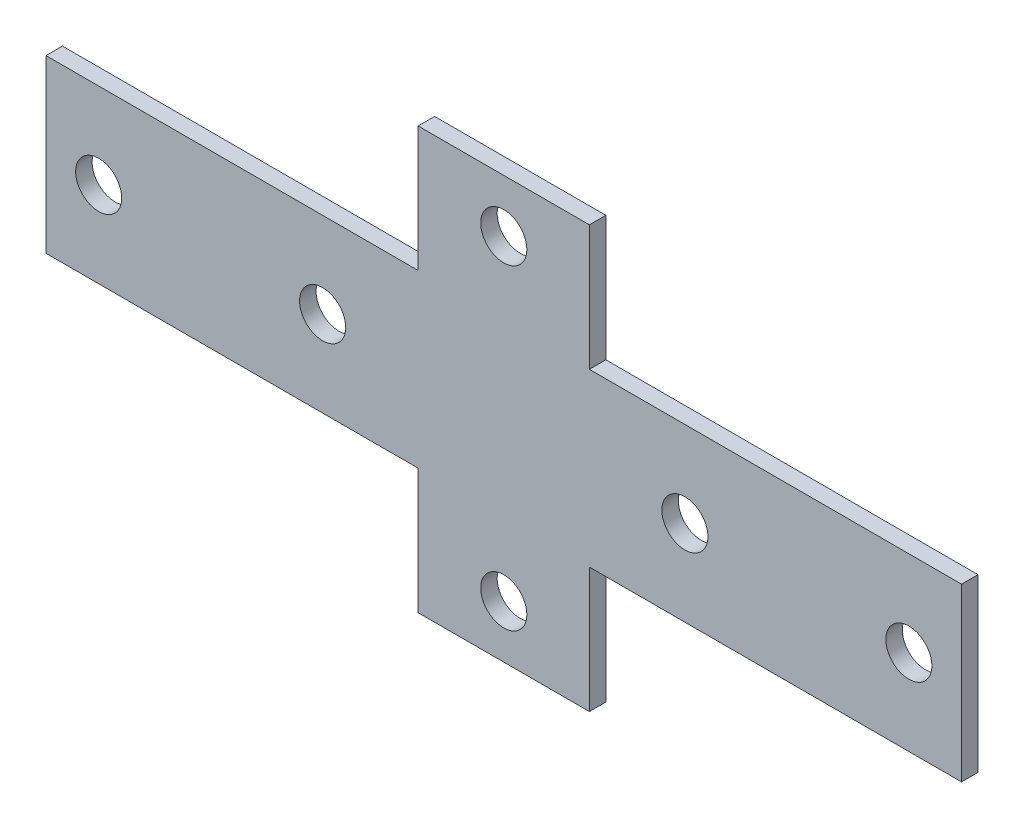
ISO-10303-21;
HEADER;
FILE_DESCRIPTION(('STEP AP214'),'2;1');
FILE_NAME('part.step','',(''),(''),'','','');
FILE_SCHEMA(('AUTOMOTIVE_DESIGN { 1 0 10303 214 1 1 1 1 }'));
ENDSEC;
DATA;
#1=APPLICATION_CONTEXT('core data for automotive mechanical design processes');
#2=APPLICATION_PROTOCOL_DEFINITION('international standard','automotive_design',2000,#1);
#3=PRODUCT_CONTEXT('',#1,'mechanical');
#4=PRODUCT('Part','Part','',(#3));
#5=PRODUCT_RELATED_PRODUCT_CATEGORY('part','',(#4));
#6=PRODUCT_DEFINITION_FORMATION('','',#4);
#7=PRODUCT_DEFINITION_CONTEXT('part definition',#1,'design');
#8=PRODUCT_DEFINITION('design','',#6,#7);
#9=PRODUCT_DEFINITION_SHAPE('','',#8);
#10=(LENGTH_UNIT() NAMED_UNIT(*) SI_UNIT(.MILLI.,.METRE.));
#11=(NAMED_UNIT(*) PLANE_ANGLE_UNIT() SI_UNIT($,.RADIAN.));
#12=(NAMED_UNIT(*) SI_UNIT($,.STERADIAN.) SOLID_ANGLE_UNIT());
#13=UNCERTAINTY_MEASURE_WITH_UNIT(LENGTH_MEASURE(1.E-05),#10,'distance_accuracy_value','');
#14=(GEOMETRIC_REPRESENTATION_CONTEXT(3) GLOBAL_UNCERTAINTY_ASSIGNED_CONTEXT((#13)) GLOBAL_UNIT_ASSIGNED_CONTEXT((#10,
#11,#12)) REPRESENTATION_CONTEXT('',''));
#15=CARTESIAN_POINT('',(0.,0.,0.));
#16=DIRECTION('',(0.,0.,1.));
#17=DIRECTION('',(1.,0.,0.));
#18=AXIS2_PLACEMENT_3D('',#15,#16,#17);
#19=CARTESIAN_POINT('',(0.,0.,2.5));
#20=DIRECTION('',(0.,0.,1.));
#21=DIRECTION('',(1.,0.,0.));
#22=AXIS2_PLACEMENT_3D('',#19,#20,#21);
#23=PLANE('',#22);
#24=CARTESIAN_POINT('',(27.4999999999999,0.,2.5));
#25=DIRECTION('',(0.,0.,1.));
#26=DIRECTION('',(-1.,0.,0.));
#27=AXIS2_PLACEMENT_3D('',#24,#25,#26);
#28=CIRCLE('',#27,3.5);
#29=CARTESIAN_POINT('',(23.9999999999999,0.,2.5));
#30=VERTEX_POINT('',#29);
#31=EDGE_CURVE('E300',#30,#30,#28,.T.);
#32=ORIENTED_EDGE('',*,*,#31,.F.);
#33=EDGE_LOOP('',(#32));
#34=FACE_BOUND('',#33,.T.);
#35=CARTESIAN_POINT('',(-61.4999999999999,0.,2.5));
#36=DIRECTION('',(0.,0.,1.));
#37=DIRECTION('',(1.,0.,0.));
#38=AXIS2_PLACEMENT_3D('',#35,#36,#37);
#39=CIRCLE('',#38,3.5);
#40=CARTESIAN_POINT('',(-57.9999999999999,0.,2.5));
#41=VERTEX_POINT('',#40);
#42=EDGE_CURVE('E312',#41,#41,#39,.T.);
#43=ORIENTED_EDGE('',*,*,#42,.F.);
#44=EDGE_LOOP('',(#43));
#45=FACE_BOUND('',#44,.T.);
#46=CARTESIAN_POINT('',(0.,-24.,2.5));
#47=DIRECTION('',(0.,0.,1.));
#48=DIRECTION('',(1.,0.,0.));
#49=AXIS2_PLACEMENT_3D('',#46,#47,#48);
#50=CIRCLE('',#49,3.5);
#51=CARTESIAN_POINT('',(3.5,-24.,2.5));
#52=VERTEX_POINT('',#51);
#53=EDGE_CURVE('E159',#52,#52,#50,.T.);
#54=ORIENTED_EDGE('',*,*,#53,.F.);
#55=EDGE_LOOP('',(#54));
#56=FACE_BOUND('',#55,.T.);
#57=DIRECTION('',(0.,1.,0.));
#58=VECTOR('',#57,1.);
#59=CARTESIAN_POINT('',(69.5000000000001,13.,2.5));
#60=LINE('',#59,#58);
#61=CARTESIAN_POINT('',(69.5000000000001,-13.,2.5));
#62=VERTEX_POINT('',#61);
#63=CARTESIAN_POINT('',(69.5000000000001,13.,2.5));
#64=VERTEX_POINT('',#63);
#65=EDGE_CURVE('E178',#62,#64,#60,.T.);
#66=ORIENTED_EDGE('',*,*,#65,.T.);
#67=DIRECTION('',(-1.,0.,0.));
#68=VECTOR('',#67,1.);
#69=CARTESIAN_POINT('',(13.,13.,2.5));
#70=LINE('',#69,#68);
#71=CARTESIAN_POINT('',(13.,13.,2.5));
#72=VERTEX_POINT('',#71);
#73=EDGE_CURVE('E106',#64,#72,#70,.T.);
#74=ORIENTED_EDGE('',*,*,#73,.T.);
#75=DIRECTION('',(0.,1.,0.));
#76=VECTOR('',#75,1.);
#77=CARTESIAN_POINT('',(13.,13.,2.5));
#78=LINE('',#77,#76);
#79=CARTESIAN_POINT('',(13.,32.,2.5));
#80=VERTEX_POINT('',#79);
#81=EDGE_CURVE('E205',#72,#80,#78,.T.);
#82=ORIENTED_EDGE('',*,*,#81,.T.);
#83=DIRECTION('',(-1.,0.,0.));
#84=VECTOR('',#83,1.);
#85=CARTESIAN_POINT('',(-13.,32.,2.5));
#86=LINE('',#85,#84);
#87=CARTESIAN_POINT('',(-13.,32.,2.5));
#88=VERTEX_POINT('',#87);
#89=EDGE_CURVE('E224',#80,#88,#86,.T.);
#90=ORIENTED_EDGE('',*,*,#89,.T.);
#91=DIRECTION('',(0.,-1.,0.));
#92=VECTOR('',#91,1.);
#93=CARTESIAN_POINT('',(-13.,13.,2.5));
#94=LINE('',#93,#92);
#95=CARTESIAN_POINT('',(-13.,13.,2.5));
#96=VERTEX_POINT('',#95);
#97=EDGE_CURVE('E221',#88,#96,#94,.T.);
#98=ORIENTED_EDGE('',*,*,#97,.T.);
#99=DIRECTION('',(-1.,0.,0.));
#100=VECTOR('',#99,1.);
#101=CARTESIAN_POINT('',(-69.4999999999999,13.,2.5));
#102=LINE('',#101,#100);
#103=CARTESIAN_POINT('',(-69.4999999999999,13.,2.5));
#104=VERTEX_POINT('',#103);
#105=EDGE_CURVE('E223',#96,#104,#102,.T.);
#106=ORIENTED_EDGE('',*,*,#105,.T.);
#107=DIRECTION('',(0.,-1.,0.));
#108=VECTOR('',#107,1.);
#109=CARTESIAN_POINT('',(-69.4999999999999,13.,2.5));
#110=LINE('',#109,#108);
#111=CARTESIAN_POINT('',(-69.4999999999999,-13.,2.5));
#112=VERTEX_POINT('',#111);
#113=EDGE_CURVE('E226',#104,#112,#110,.T.);
#114=ORIENTED_EDGE('',*,*,#113,.T.);
#115=DIRECTION('',(1.,0.,0.));
#116=VECTOR('',#115,1.);
#117=CARTESIAN_POINT('',(-69.4999999999999,-13.,2.5));
#118=LINE('',#117,#116);
#119=CARTESIAN_POINT('',(-13.,-13.,2.5));
#120=VERTEX_POINT('',#119);
#121=EDGE_CURVE('E232',#112,#120,#118,.T.);
#122=ORIENTED_EDGE('',*,*,#121,.T.);
#123=DIRECTION('',(0.,-1.,0.));
#124=VECTOR('',#123,1.);
#125=CARTESIAN_POINT('',(-13.,-32.,2.5));
#126=LINE('',#125,#124);
#127=CARTESIAN_POINT('',(-13.,-32.,2.5));
#128=VERTEX_POINT('',#127);
#129=EDGE_CURVE('E137',#120,#128,#126,.T.);
#130=ORIENTED_EDGE('',*,*,#129,.T.);
#131=DIRECTION('',(1.,0.,0.));
#132=VECTOR('',#131,1.);
#133=CARTESIAN_POINT('',(-13.,-32.,2.5));
#134=LINE('',#133,#132);
#135=CARTESIAN_POINT('',(13.,-32.,2.5));
#136=VERTEX_POINT('',#135);
#137=EDGE_CURVE('E131',#128,#136,#134,.T.);
#138=ORIENTED_EDGE('',*,*,#137,.T.);
#139=DIRECTION('',(0.,1.,0.));
#140=VECTOR('',#139,1.);
#141=CARTESIAN_POINT('',(13.,-32.,2.5));
#142=LINE('',#141,#140);
#143=CARTESIAN_POINT('',(13.,-13.,2.5));
#144=VERTEX_POINT('',#143);
#145=EDGE_CURVE('E135',#136,#144,#142,.T.);
#146=ORIENTED_EDGE('',*,*,#145,.T.);
#147=DIRECTION('',(1.,0.,0.));
#148=VECTOR('',#147,1.);
#149=CARTESIAN_POINT('',(13.,-13.,2.5));
#150=LINE('',#149,#148);
#151=EDGE_CURVE('E51',#144,#62,#150,.T.);
#152=ORIENTED_EDGE('',*,*,#151,.T.);
#153=EDGE_LOOP('',(#66,#74,#82,#90,#98,#106,#114,#122,#130,#138,#146,#152));
#154=FACE_BOUND('',#153,.T.);
#155=CARTESIAN_POINT('',(0.,24.,2.5));
#156=DIRECTION('',(0.,0.,1.));
#157=DIRECTION('',(1.,0.,0.));
#158=AXIS2_PLACEMENT_3D('',#155,#156,#157);
#159=CIRCLE('',#158,3.5);
#160=CARTESIAN_POINT('',(3.5,24.,2.5));
#161=VERTEX_POINT('',#160);
#162=EDGE_CURVE('E318',#161,#161,#159,.T.);
#163=ORIENTED_EDGE('',*,*,#162,.F.);
#164=EDGE_LOOP('',(#163));
#165=FACE_BOUND('',#164,.T.);
#166=CARTESIAN_POINT('',(-27.4999999999999,0.,2.5));
#167=DIRECTION('',(0.,0.,1.));
#168=DIRECTION('',(1.,0.,0.));
#169=AXIS2_PLACEMENT_3D('',#166,#167,#168);
#170=CIRCLE('',#169,3.5);
#171=CARTESIAN_POINT('',(-23.9999999999999,0.,2.5));
#172=VERTEX_POINT('',#171);
#173=EDGE_CURVE('E306',#172,#172,#170,.T.);
#174=ORIENTED_EDGE('',*,*,#173,.F.);
#175=EDGE_LOOP('',(#174));
#176=FACE_BOUND('',#175,.T.);
#177=CARTESIAN_POINT('',(61.4999999999999,0.,2.5));
#178=DIRECTION('',(0.,0.,1.));
#179=DIRECTION('',(-1.,0.,0.));
#180=AXIS2_PLACEMENT_3D('',#177,#178,#179);
#181=CIRCLE('',#180,3.5);
#182=CARTESIAN_POINT('',(57.9999999999999,0.,2.5));
#183=VERTEX_POINT('',#182);
#184=EDGE_CURVE('E291',#183,#183,#181,.T.);
#185=ORIENTED_EDGE('',*,*,#184,.F.);
#186=EDGE_LOOP('',(#185));
#187=FACE_BOUND('',#186,.T.);
#188=ADVANCED_FACE('F34',(#34,#45,#56,#154,#165,#176,#187),#23,.T.);
#189=CARTESIAN_POINT('',(0.,0.,0.));
#190=DIRECTION('',(0.,0.,1.));
#191=DIRECTION('',(1.,0.,0.));
#192=AXIS2_PLACEMENT_3D('',#189,#190,#191);
#193=PLANE('',#192);
#194=DIRECTION('',(0.,1.,0.));
#195=VECTOR('',#194,1.);
#196=CARTESIAN_POINT('',(69.5000000000001,13.,0.));
#197=LINE('',#196,#195);
#198=CARTESIAN_POINT('',(69.5000000000001,-13.,0.));
#199=VERTEX_POINT('',#198);
#200=CARTESIAN_POINT('',(69.5000000000001,13.,0.));
#201=VERTEX_POINT('',#200);
#202=EDGE_CURVE('E155',#199,#201,#197,.T.);
#203=ORIENTED_EDGE('',*,*,#202,.F.);
#204=DIRECTION('',(1.,0.,0.));
#205=VECTOR('',#204,1.);
#206=CARTESIAN_POINT('',(13.,-13.,0.));
#207=LINE('',#206,#205);
#208=CARTESIAN_POINT('',(13.,-13.,0.));
#209=VERTEX_POINT('',#208);
#210=EDGE_CURVE('E98',#209,#199,#207,.T.);
#211=ORIENTED_EDGE('',*,*,#210,.F.);
#212=DIRECTION('',(0.,1.,0.));
#213=VECTOR('',#212,1.);
#214=CARTESIAN_POINT('',(13.,-32.,0.));
#215=LINE('',#214,#213);
#216=CARTESIAN_POINT('',(13.,-32.,0.));
#217=VERTEX_POINT('',#216);
#218=EDGE_CURVE('E92',#217,#209,#215,.T.);
#219=ORIENTED_EDGE('',*,*,#218,.F.);
#220=DIRECTION('',(1.,0.,0.));
#221=VECTOR('',#220,1.);
#222=CARTESIAN_POINT('',(-13.,-32.,0.));
#223=LINE('',#222,#221);
#224=CARTESIAN_POINT('',(-13.,-32.,0.));
#225=VERTEX_POINT('',#224);
#226=EDGE_CURVE('E145',#225,#217,#223,.T.);
#227=ORIENTED_EDGE('',*,*,#226,.F.);
#228=DIRECTION('',(0.,-1.,0.));
#229=VECTOR('',#228,1.);
#230=CARTESIAN_POINT('',(-13.,-32.,0.));
#231=LINE('',#230,#229);
#232=CARTESIAN_POINT('',(-13.,-13.,0.));
#233=VERTEX_POINT('',#232);
#234=EDGE_CURVE('E173',#233,#225,#231,.T.);
#235=ORIENTED_EDGE('',*,*,#234,.F.);
#236=DIRECTION('',(1.,0.,0.));
#237=VECTOR('',#236,1.);
#238=CARTESIAN_POINT('',(-69.4999999999999,-13.,0.));
#239=LINE('',#238,#237);
#240=CARTESIAN_POINT('',(-69.4999999999999,-13.,0.));
#241=VERTEX_POINT('',#240);
#242=EDGE_CURVE('E171',#241,#233,#239,.T.);
#243=ORIENTED_EDGE('',*,*,#242,.F.);
#244=DIRECTION('',(0.,-1.,0.));
#245=VECTOR('',#244,1.);
#246=CARTESIAN_POINT('',(-69.4999999999999,13.,0.));
#247=LINE('',#246,#245);
#248=CARTESIAN_POINT('',(-69.4999999999999,13.,0.));
#249=VERTEX_POINT('',#248);
#250=EDGE_CURVE('E169',#249,#241,#247,.T.);
#251=ORIENTED_EDGE('',*,*,#250,.F.);
#252=DIRECTION('',(-1.,0.,0.));
#253=VECTOR('',#252,1.);
#254=CARTESIAN_POINT('',(-69.4999999999999,13.,0.));
#255=LINE('',#254,#253);
#256=CARTESIAN_POINT('',(-13.,13.,0.));
#257=VERTEX_POINT('',#256);
#258=EDGE_CURVE('E167',#257,#249,#255,.T.);
#259=ORIENTED_EDGE('',*,*,#258,.F.);
#260=DIRECTION('',(0.,-1.,0.));
#261=VECTOR('',#260,1.);
#262=CARTESIAN_POINT('',(-13.,13.,0.));
#263=LINE('',#262,#261);
#264=CARTESIAN_POINT('',(-13.,32.,0.));
#265=VERTEX_POINT('',#264);
#266=EDGE_CURVE('E165',#265,#257,#263,.T.);
#267=ORIENTED_EDGE('',*,*,#266,.F.);
#268=DIRECTION('',(-1.,0.,0.));
#269=VECTOR('',#268,1.);
#270=CARTESIAN_POINT('',(-13.,32.,0.));
#271=LINE('',#270,#269);
#272=CARTESIAN_POINT('',(13.,32.,0.));
#273=VERTEX_POINT('',#272);
#274=EDGE_CURVE('E163',#273,#265,#271,.T.);
#275=ORIENTED_EDGE('',*,*,#274,.F.);
#276=DIRECTION('',(0.,1.,0.));
#277=VECTOR('',#276,1.);
#278=CARTESIAN_POINT('',(13.,13.,0.));
#279=LINE('',#278,#277);
#280=CARTESIAN_POINT('',(13.,13.,0.));
#281=VERTEX_POINT('',#280);
#282=EDGE_CURVE('E161',#281,#273,#279,.T.);
#283=ORIENTED_EDGE('',*,*,#282,.F.);
#284=DIRECTION('',(-1.,0.,0.));
#285=VECTOR('',#284,1.);
#286=CARTESIAN_POINT('',(13.,13.,0.));
#287=LINE('',#286,#285);
#288=EDGE_CURVE('E158',#201,#281,#287,.T.);
#289=ORIENTED_EDGE('',*,*,#288,.F.);
#290=EDGE_LOOP('',(#203,#211,#219,#227,#235,#243,#251,#259,#267,#275,#283,#289));
#291=FACE_BOUND('',#290,.T.);
#292=CARTESIAN_POINT('',(0.,-24.,0.));
#293=DIRECTION('',(0.,0.,1.));
#294=DIRECTION('',(1.,0.,0.));
#295=AXIS2_PLACEMENT_3D('',#292,#293,#294);
#296=CIRCLE('',#295,3.5);
#297=CARTESIAN_POINT('',(3.5,-24.,0.));
#298=VERTEX_POINT('',#297);
#299=EDGE_CURVE('E321',#298,#298,#296,.T.);
#300=ORIENTED_EDGE('',*,*,#299,.T.);
#301=EDGE_LOOP('',(#300));
#302=FACE_BOUND('',#301,.T.);
#303=CARTESIAN_POINT('',(0.,24.,0.));
#304=DIRECTION('',(0.,0.,1.));
#305=DIRECTION('',(1.,0.,0.));
#306=AXIS2_PLACEMENT_3D('',#303,#304,#305);
#307=CIRCLE('',#306,3.5);
#308=CARTESIAN_POINT('',(3.5,24.,0.));
#309=VERTEX_POINT('',#308);
#310=EDGE_CURVE('E315',#309,#309,#307,.T.);
#311=ORIENTED_EDGE('',*,*,#310,.T.);
#312=EDGE_LOOP('',(#311));
#313=FACE_BOUND('',#312,.T.);
#314=CARTESIAN_POINT('',(-61.4999999999999,0.,0.));
#315=DIRECTION('',(0.,0.,1.));
#316=DIRECTION('',(1.,0.,0.));
#317=AXIS2_PLACEMENT_3D('',#314,#315,#316);
#318=CIRCLE('',#317,3.5);
#319=CARTESIAN_POINT('',(-57.9999999999999,0.,0.));
#320=VERTEX_POINT('',#319);
#321=EDGE_CURVE('E309',#320,#320,#318,.T.);
#322=ORIENTED_EDGE('',*,*,#321,.T.);
#323=EDGE_LOOP('',(#322));
#324=FACE_BOUND('',#323,.T.);
#325=CARTESIAN_POINT('',(-27.4999999999999,0.,0.));
#326=DIRECTION('',(0.,0.,1.));
#327=DIRECTION('',(1.,0.,0.));
#328=AXIS2_PLACEMENT_3D('',#325,#326,#327);
#329=CIRCLE('',#328,3.5);
#330=CARTESIAN_POINT('',(-23.9999999999999,0.,0.));
#331=VERTEX_POINT('',#330);
#332=EDGE_CURVE('E303',#331,#331,#329,.T.);
#333=ORIENTED_EDGE('',*,*,#332,.T.);
#334=EDGE_LOOP('',(#333));
#335=FACE_BOUND('',#334,.T.);
#336=CARTESIAN_POINT('',(27.4999999999999,0.,0.));
#337=DIRECTION('',(0.,0.,1.));
#338=DIRECTION('',(-1.,0.,0.));
#339=AXIS2_PLACEMENT_3D('',#336,#337,#338);
#340=CIRCLE('',#339,3.5);
#341=CARTESIAN_POINT('',(23.9999999999999,0.,0.));
#342=VERTEX_POINT('',#341);
#343=EDGE_CURVE('E297',#342,#342,#340,.T.);
#344=ORIENTED_EDGE('',*,*,#343,.T.);
#345=EDGE_LOOP('',(#344));
#346=FACE_BOUND('',#345,.T.);
#347=CARTESIAN_POINT('',(61.4999999999999,0.,0.));
#348=DIRECTION('',(0.,0.,1.));
#349=DIRECTION('',(-1.,0.,0.));
#350=AXIS2_PLACEMENT_3D('',#347,#348,#349);
#351=CIRCLE('',#350,3.5);
#352=CARTESIAN_POINT('',(57.9999999999999,0.,0.));
#353=VERTEX_POINT('',#352);
#354=EDGE_CURVE('E294',#353,#353,#351,.T.);
#355=ORIENTED_EDGE('',*,*,#354,.T.);
#356=EDGE_LOOP('',(#355));
#357=FACE_BOUND('',#356,.T.);
#358=ADVANCED_FACE('F209',(#291,#302,#313,#324,#335,#346,#357),#193,.F.);
#359=CARTESIAN_POINT('',(69.5000000000001,13.,2.5));
#360=DIRECTION('',(-1.,0.,0.));
#361=DIRECTION('',(0.,0.,1.));
#362=AXIS2_PLACEMENT_3D('',#359,#360,#361);
#363=PLANE('',#362);
#364=ORIENTED_EDGE('',*,*,#202,.T.);
#365=DIRECTION('',(0.,0.,-1.));
#366=VECTOR('',#365,1.);
#367=CARTESIAN_POINT('',(69.5000000000001,13.,2.5));
#368=LINE('',#367,#366);
#369=EDGE_CURVE('E11',#64,#201,#368,.T.);
#370=ORIENTED_EDGE('',*,*,#369,.F.);
#371=ORIENTED_EDGE('',*,*,#65,.F.);
#372=DIRECTION('',(0.,0.,-1.));
#373=VECTOR('',#372,1.);
#374=CARTESIAN_POINT('',(69.5000000000001,-13.,2.5));
#375=LINE('',#374,#373);
#376=EDGE_CURVE('E151',#62,#199,#375,.T.);
#377=ORIENTED_EDGE('',*,*,#376,.T.);
#378=EDGE_LOOP('',(#364,#370,#371,#377));
#379=FACE_BOUND('',#378,.T.);
#380=ADVANCED_FACE('F36',(#379),#363,.F.);
#381=CARTESIAN_POINT('',(13.,13.,2.5));
#382=DIRECTION('',(0.,-1.,0.));
#383=DIRECTION('',(1.,0.,0.));
#384=AXIS2_PLACEMENT_3D('',#381,#382,#383);
#385=PLANE('',#384);
#386=ORIENTED_EDGE('',*,*,#288,.T.);
#387=DIRECTION('',(0.,0.,-1.));
#388=VECTOR('',#387,1.);
#389=CARTESIAN_POINT('',(13.,13.,2.5));
#390=LINE('',#389,#388);
#391=EDGE_CURVE('E43',#72,#281,#390,.T.);
#392=ORIENTED_EDGE('',*,*,#391,.F.);
#393=ORIENTED_EDGE('',*,*,#73,.F.);
#394=ORIENTED_EDGE('',*,*,#369,.T.);
#395=EDGE_LOOP('',(#386,#392,#393,#394));
#396=FACE_BOUND('',#395,.T.);
#397=ADVANCED_FACE('F449',(#396),#385,.F.);
#398=CARTESIAN_POINT('',(13.,13.,2.5));
#399=DIRECTION('',(-1.,0.,0.));
#400=DIRECTION('',(0.,-1.,0.));
#401=AXIS2_PLACEMENT_3D('',#398,#399,#400);
#402=PLANE('',#401);
#403=ORIENTED_EDGE('',*,*,#282,.T.);
#404=DIRECTION('',(0.,0.,-1.));
#405=VECTOR('',#404,1.);
#406=CARTESIAN_POINT('',(13.,32.,2.5));
#407=LINE('',#406,#405);
#408=EDGE_CURVE('E197',#80,#273,#407,.T.);
#409=ORIENTED_EDGE('',*,*,#408,.F.);
#410=ORIENTED_EDGE('',*,*,#81,.F.);
#411=ORIENTED_EDGE('',*,*,#391,.T.);
#412=EDGE_LOOP('',(#403,#409,#410,#411));
#413=FACE_BOUND('',#412,.T.);
#414=ADVANCED_FACE('F203',(#413),#402,.F.);
#415=CARTESIAN_POINT('',(-13.,32.,2.5));
#416=DIRECTION('',(0.,-1.,0.));
#417=DIRECTION('',(0.,0.,-1.));
#418=AXIS2_PLACEMENT_3D('',#415,#416,#417);
#419=PLANE('',#418);
#420=ORIENTED_EDGE('',*,*,#274,.T.);
#421=DIRECTION('',(0.,0.,-1.));
#422=VECTOR('',#421,1.);
#423=CARTESIAN_POINT('',(-13.,32.,2.5));
#424=LINE('',#423,#422);
#425=EDGE_CURVE('E194',#88,#265,#424,.T.);
#426=ORIENTED_EDGE('',*,*,#425,.F.);
#427=ORIENTED_EDGE('',*,*,#89,.F.);
#428=ORIENTED_EDGE('',*,*,#408,.T.);
#429=EDGE_LOOP('',(#420,#426,#427,#428));
#430=FACE_BOUND('',#429,.T.);
#431=ADVANCED_FACE('F215',(#430),#419,.F.);
#432=CARTESIAN_POINT('',(-13.,13.,2.5));
#433=DIRECTION('',(1.,0.,0.));
#434=DIRECTION('',(0.,1.,0.));
#435=AXIS2_PLACEMENT_3D('',#432,#433,#434);
#436=PLANE('',#435);
#437=ORIENTED_EDGE('',*,*,#266,.T.);
#438=DIRECTION('',(0.,0.,-1.));
#439=VECTOR('',#438,1.);
#440=CARTESIAN_POINT('',(-13.,13.,2.5));
#441=LINE('',#440,#439);
#442=EDGE_CURVE('E191',#96,#257,#441,.T.);
#443=ORIENTED_EDGE('',*,*,#442,.F.);
#444=ORIENTED_EDGE('',*,*,#97,.F.);
#445=ORIENTED_EDGE('',*,*,#425,.T.);
#446=EDGE_LOOP('',(#437,#443,#444,#445));
#447=FACE_BOUND('',#446,.T.);
#448=ADVANCED_FACE('F219',(#447),#436,.F.);
#449=CARTESIAN_POINT('',(-69.4999999999999,13.,2.5));
#450=DIRECTION('',(0.,-1.,0.));
#451=DIRECTION('',(1.,0.,0.));
#452=AXIS2_PLACEMENT_3D('',#449,#450,#451);
#453=PLANE('',#452);
#454=ORIENTED_EDGE('',*,*,#258,.T.);
#455=DIRECTION('',(0.,0.,-1.));
#456=VECTOR('',#455,1.);
#457=CARTESIAN_POINT('',(-69.4999999999999,13.,2.5));
#458=LINE('',#457,#456);
#459=EDGE_CURVE('E188',#104,#249,#458,.T.);
#460=ORIENTED_EDGE('',*,*,#459,.F.);
#461=ORIENTED_EDGE('',*,*,#105,.F.);
#462=ORIENTED_EDGE('',*,*,#442,.T.);
#463=EDGE_LOOP('',(#454,#460,#461,#462));
#464=FACE_BOUND('',#463,.T.);
#465=ADVANCED_FACE('F414',(#464),#453,.F.);
#466=CARTESIAN_POINT('',(-69.4999999999999,13.,2.5));
#467=DIRECTION('',(1.,0.,0.));
#468=DIRECTION('',(0.,0.,-1.));
#469=AXIS2_PLACEMENT_3D('',#466,#467,#468);
#470=PLANE('',#469);
#471=ORIENTED_EDGE('',*,*,#250,.T.);
#472=DIRECTION('',(0.,0.,-1.));
#473=VECTOR('',#472,1.);
#474=CARTESIAN_POINT('',(-69.4999999999999,-13.,2.5));
#475=LINE('',#474,#473);
#476=EDGE_CURVE('E185',#112,#241,#475,.T.);
#477=ORIENTED_EDGE('',*,*,#476,.F.);
#478=ORIENTED_EDGE('',*,*,#113,.F.);
#479=ORIENTED_EDGE('',*,*,#459,.T.);
#480=EDGE_LOOP('',(#471,#477,#478,#479));
#481=FACE_BOUND('',#480,.T.);
#482=ADVANCED_FACE('F405',(#481),#470,.F.);
#483=CARTESIAN_POINT('',(-69.4999999999999,-13.,2.5));
#484=DIRECTION('',(0.,1.,0.));
#485=DIRECTION('',(-1.,0.,0.));
#486=AXIS2_PLACEMENT_3D('',#483,#484,#485);
#487=PLANE('',#486);
#488=ORIENTED_EDGE('',*,*,#242,.T.);
#489=DIRECTION('',(0.,0.,-1.));
#490=VECTOR('',#489,1.);
#491=CARTESIAN_POINT('',(-13.,-13.,2.5));
#492=LINE('',#491,#490);
#493=EDGE_CURVE('E182',#120,#233,#492,.T.);
#494=ORIENTED_EDGE('',*,*,#493,.F.);
#495=ORIENTED_EDGE('',*,*,#121,.F.);
#496=ORIENTED_EDGE('',*,*,#476,.T.);
#497=EDGE_LOOP('',(#488,#494,#495,#496));
#498=FACE_BOUND('',#497,.T.);
#499=ADVANCED_FACE('F238',(#498),#487,.F.);
#500=CARTESIAN_POINT('',(-13.,-32.,2.5));
#501=DIRECTION('',(1.,0.,0.));
#502=DIRECTION('',(0.,1.,0.));
#503=AXIS2_PLACEMENT_3D('',#500,#501,#502);
#504=PLANE('',#503);
#505=ORIENTED_EDGE('',*,*,#234,.T.);
#506=DIRECTION('',(0.,0.,-1.));
#507=VECTOR('',#506,1.);
#508=CARTESIAN_POINT('',(-13.,-32.,2.5));
#509=LINE('',#508,#507);
#510=EDGE_CURVE('E146',#128,#225,#509,.T.);
#511=ORIENTED_EDGE('',*,*,#510,.F.);
#512=ORIENTED_EDGE('',*,*,#129,.F.);
#513=ORIENTED_EDGE('',*,*,#493,.T.);
#514=EDGE_LOOP('',(#505,#511,#512,#513));
#515=FACE_BOUND('',#514,.T.);
#516=ADVANCED_FACE('F242',(#515),#504,.F.);
#517=CARTESIAN_POINT('',(-13.,-32.,2.5));
#518=DIRECTION('',(0.,1.,0.));
#519=DIRECTION('',(0.,0.,1.));
#520=AXIS2_PLACEMENT_3D('',#517,#518,#519);
#521=PLANE('',#520);
#522=ORIENTED_EDGE('',*,*,#226,.T.);
#523=DIRECTION('',(0.,0.,-1.));
#524=VECTOR('',#523,1.);
#525=CARTESIAN_POINT('',(13.,-32.,2.5));
#526=LINE('',#525,#524);
#527=EDGE_CURVE('E142',#136,#217,#526,.T.);
#528=ORIENTED_EDGE('',*,*,#527,.F.);
#529=ORIENTED_EDGE('',*,*,#137,.F.);
#530=ORIENTED_EDGE('',*,*,#510,.T.);
#531=EDGE_LOOP('',(#522,#528,#529,#530));
#532=FACE_BOUND('',#531,.T.);
#533=ADVANCED_FACE('F143',(#532),#521,.F.);
#534=CARTESIAN_POINT('',(13.,-32.,2.5));
#535=DIRECTION('',(-1.,0.,0.));
#536=DIRECTION('',(0.,-1.,0.));
#537=AXIS2_PLACEMENT_3D('',#534,#535,#536);
#538=PLANE('',#537);
#539=ORIENTED_EDGE('',*,*,#218,.T.);
#540=DIRECTION('',(0.,0.,-1.));
#541=VECTOR('',#540,1.);
#542=CARTESIAN_POINT('',(13.,-13.,2.5));
#543=LINE('',#542,#541);
#544=EDGE_CURVE('E147',#144,#209,#543,.T.);
#545=ORIENTED_EDGE('',*,*,#544,.F.);
#546=ORIENTED_EDGE('',*,*,#145,.F.);
#547=ORIENTED_EDGE('',*,*,#527,.T.);
#548=EDGE_LOOP('',(#539,#545,#546,#547));
#549=FACE_BOUND('',#548,.T.);
#550=ADVANCED_FACE('F149',(#549),#538,.F.);
#551=CARTESIAN_POINT('',(13.,-13.,2.5));
#552=DIRECTION('',(0.,1.,0.));
#553=DIRECTION('',(-1.,0.,0.));
#554=AXIS2_PLACEMENT_3D('',#551,#552,#553);
#555=PLANE('',#554);
#556=ORIENTED_EDGE('',*,*,#210,.T.);
#557=ORIENTED_EDGE('',*,*,#376,.F.);
#558=ORIENTED_EDGE('',*,*,#151,.F.);
#559=ORIENTED_EDGE('',*,*,#544,.T.);
#560=EDGE_LOOP('',(#556,#557,#558,#559));
#561=FACE_BOUND('',#560,.T.);
#562=ADVANCED_FACE('F246',(#561),#555,.F.);
#563=CARTESIAN_POINT('',(0.,-24.,2.5));
#564=DIRECTION('',(0.,0.,-1.));
#565=DIRECTION('',(-1.,0.,0.));
#566=AXIS2_PLACEMENT_3D('',#563,#564,#565);
#567=CYLINDRICAL_SURFACE('',#566,3.5);
#568=ORIENTED_EDGE('',*,*,#53,.T.);
#569=EDGE_LOOP('',(#568));
#570=FACE_BOUND('',#569,.T.);
#571=ORIENTED_EDGE('',*,*,#299,.F.);
#572=EDGE_LOOP('',(#571));
#573=FACE_BOUND('',#572,.T.);
#574=ADVANCED_FACE('F248',(#570,#573),#567,.F.);
#575=CARTESIAN_POINT('',(0.,24.,2.5));
#576=DIRECTION('',(0.,0.,-1.));
#577=DIRECTION('',(-1.,0.,0.));
#578=AXIS2_PLACEMENT_3D('',#575,#576,#577);
#579=CYLINDRICAL_SURFACE('',#578,3.5);
#580=ORIENTED_EDGE('',*,*,#162,.T.);
#581=EDGE_LOOP('',(#580));
#582=FACE_BOUND('',#581,.T.);
#583=ORIENTED_EDGE('',*,*,#310,.F.);
#584=EDGE_LOOP('',(#583));
#585=FACE_BOUND('',#584,.T.);
#586=ADVANCED_FACE('F254',(#582,#585),#579,.F.);
#587=CARTESIAN_POINT('',(-61.4999999999999,0.,2.5));
#588=DIRECTION('',(0.,0.,-1.));
#589=DIRECTION('',(-1.,0.,0.));
#590=AXIS2_PLACEMENT_3D('',#587,#588,#589);
#591=CYLINDRICAL_SURFACE('',#590,3.5);
#592=ORIENTED_EDGE('',*,*,#42,.T.);
#593=EDGE_LOOP('',(#592));
#594=FACE_BOUND('',#593,.T.);
#595=ORIENTED_EDGE('',*,*,#321,.F.);
#596=EDGE_LOOP('',(#595));
#597=FACE_BOUND('',#596,.T.);
#598=ADVANCED_FACE('F270',(#594,#597),#591,.F.);
#599=CARTESIAN_POINT('',(-27.4999999999999,0.,2.5));
#600=DIRECTION('',(0.,0.,-1.));
#601=DIRECTION('',(-1.,0.,0.));
#602=AXIS2_PLACEMENT_3D('',#599,#600,#601);
#603=CYLINDRICAL_SURFACE('',#602,3.5);
#604=ORIENTED_EDGE('',*,*,#173,.T.);
#605=EDGE_LOOP('',(#604));
#606=FACE_BOUND('',#605,.T.);
#607=ORIENTED_EDGE('',*,*,#332,.F.);
#608=EDGE_LOOP('',(#607));
#609=FACE_BOUND('',#608,.T.);
#610=ADVANCED_FACE('F274',(#606,#609),#603,.F.);
#611=CARTESIAN_POINT('',(27.4999999999999,0.,2.5));
#612=DIRECTION('',(0.,0.,-1.));
#613=DIRECTION('',(-1.,0.,0.));
#614=AXIS2_PLACEMENT_3D('',#611,#612,#613);
#615=CYLINDRICAL_SURFACE('',#614,3.5);
#616=ORIENTED_EDGE('',*,*,#31,.T.);
#617=EDGE_LOOP('',(#616));
#618=FACE_BOUND('',#617,.T.);
#619=ORIENTED_EDGE('',*,*,#343,.F.);
#620=EDGE_LOOP('',(#619));
#621=FACE_BOUND('',#620,.T.);
#622=ADVANCED_FACE('F278',(#618,#621),#615,.F.);
#623=CARTESIAN_POINT('',(61.4999999999999,0.,2.5));
#624=DIRECTION('',(0.,0.,-1.));
#625=DIRECTION('',(-1.,0.,0.));
#626=AXIS2_PLACEMENT_3D('',#623,#624,#625);
#627=CYLINDRICAL_SURFACE('',#626,3.5);
#628=ORIENTED_EDGE('',*,*,#184,.T.);
#629=EDGE_LOOP('',(#628));
#630=FACE_BOUND('',#629,.T.);
#631=ORIENTED_EDGE('',*,*,#354,.F.);
#632=EDGE_LOOP('',(#631));
#633=FACE_BOUND('',#632,.T.);
#634=ADVANCED_FACE('F282',(#630,#633),#627,.F.);
#635=CLOSED_SHELL('',(#188,#358,#380,#397,#414,#431,#448,#465,#482,#499,#516,#533,#550,#562,
#574,#586,#598,#610,#622,#634));
#636=MANIFOLD_SOLID_BREP('B2',#635);
#637=ADVANCED_BREP_SHAPE_REPRESENTATION('',(#18,#636),#14);
#638=SHAPE_DEFINITION_REPRESENTATION(#9,#637);
ENDSEC;
END-ISO-10303-21;
